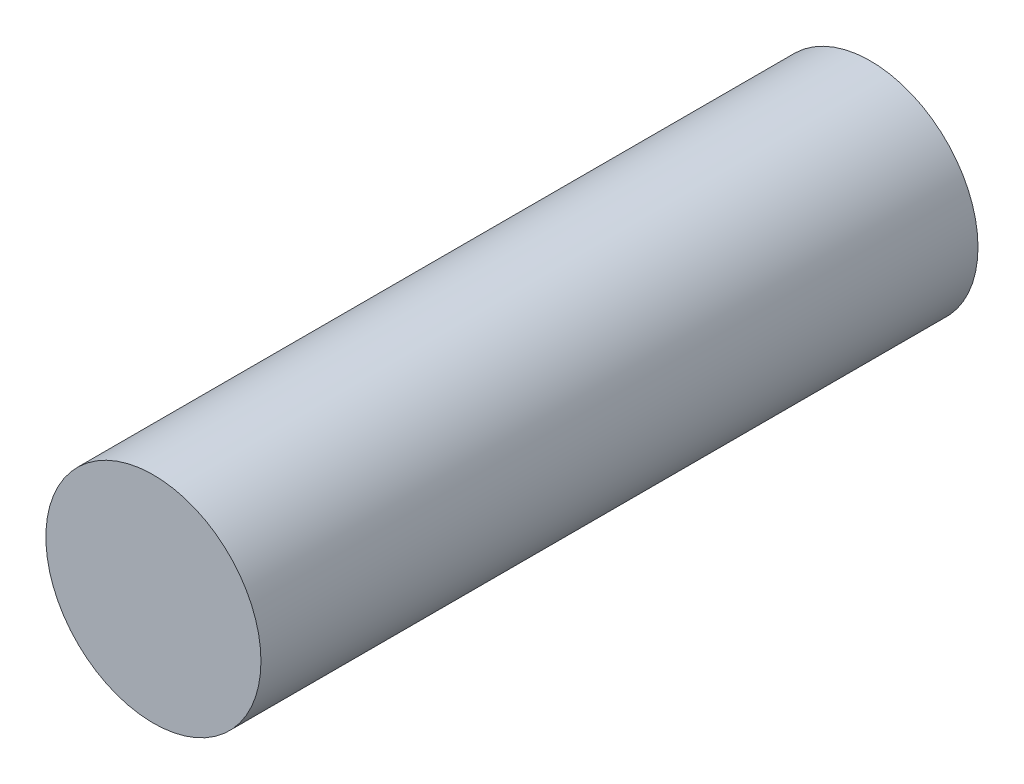
ISO-10303-21;
HEADER;
FILE_DESCRIPTION(('STEP AP214'),'2;1');
FILE_NAME('part.step','',(''),(''),'','','');
FILE_SCHEMA(('AUTOMOTIVE_DESIGN { 1 0 10303 214 1 1 1 1 }'));
ENDSEC;
DATA;
#1=APPLICATION_CONTEXT('core data for automotive mechanical design processes');
#2=APPLICATION_PROTOCOL_DEFINITION('international standard','automotive_design',2000,#1);
#3=PRODUCT_CONTEXT('',#1,'mechanical');
#4=PRODUCT('Part','Part','',(#3));
#5=PRODUCT_RELATED_PRODUCT_CATEGORY('part','',(#4));
#6=PRODUCT_DEFINITION_FORMATION('','',#4);
#7=PRODUCT_DEFINITION_CONTEXT('part definition',#1,'design');
#8=PRODUCT_DEFINITION('design','',#6,#7);
#9=PRODUCT_DEFINITION_SHAPE('','',#8);
#10=(LENGTH_UNIT() NAMED_UNIT(*) SI_UNIT(.MILLI.,.METRE.));
#11=(NAMED_UNIT(*) PLANE_ANGLE_UNIT() SI_UNIT($,.RADIAN.));
#12=(NAMED_UNIT(*) SI_UNIT($,.STERADIAN.) SOLID_ANGLE_UNIT());
#13=UNCERTAINTY_MEASURE_WITH_UNIT(LENGTH_MEASURE(1.E-05),#10,'distance_accuracy_value','');
#14=(GEOMETRIC_REPRESENTATION_CONTEXT(3) GLOBAL_UNCERTAINTY_ASSIGNED_CONTEXT((#13)) GLOBAL_UNIT_ASSIGNED_CONTEXT((#10,
#11,#12)) REPRESENTATION_CONTEXT('',''));
#15=CARTESIAN_POINT('',(0.,0.,0.));
#16=DIRECTION('',(0.,0.,1.));
#17=DIRECTION('',(1.,0.,0.));
#18=AXIS2_PLACEMENT_3D('',#15,#16,#17);
#19=CARTESIAN_POINT('',(0.,0.,100.));
#20=DIRECTION('',(0.,0.,-1.));
#21=DIRECTION('',(-1.,0.,0.));
#22=AXIS2_PLACEMENT_3D('',#19,#20,#21);
#23=CYLINDRICAL_SURFACE('',#22,15.);
#24=CARTESIAN_POINT('',(0.,0.,100.));
#25=DIRECTION('',(0.,0.,1.));
#26=DIRECTION('',(1.,0.,0.));
#27=AXIS2_PLACEMENT_3D('',#24,#25,#26);
#28=CIRCLE('',#27,15.);
#29=CARTESIAN_POINT('',(15.,0.,100.));
#30=VERTEX_POINT('',#29);
#31=EDGE_CURVE('E10',#30,#30,#28,.T.);
#32=ORIENTED_EDGE('',*,*,#31,.F.);
#33=EDGE_LOOP('',(#32));
#34=FACE_BOUND('',#33,.T.);
#35=CARTESIAN_POINT('',(0.,0.,0.));
#36=DIRECTION('',(0.,0.,1.));
#37=DIRECTION('',(1.,0.,0.));
#38=AXIS2_PLACEMENT_3D('',#35,#36,#37);
#39=CIRCLE('',#38,15.);
#40=CARTESIAN_POINT('',(15.,0.,0.));
#41=VERTEX_POINT('',#40);
#42=EDGE_CURVE('E18',#41,#41,#39,.T.);
#43=ORIENTED_EDGE('',*,*,#42,.T.);
#44=EDGE_LOOP('',(#43));
#45=FACE_BOUND('',#44,.T.);
#46=ADVANCED_FACE('F15',(#34,#45),#23,.T.);
#47=CARTESIAN_POINT('',(0.,0.,100.));
#48=DIRECTION('',(0.,0.,1.));
#49=DIRECTION('',(1.,0.,0.));
#50=AXIS2_PLACEMENT_3D('',#47,#48,#49);
#51=PLANE('',#50);
#52=ORIENTED_EDGE('',*,*,#31,.T.);
#53=EDGE_LOOP('',(#52));
#54=FACE_BOUND('',#53,.T.);
#55=ADVANCED_FACE('F30',(#54),#51,.T.);
#56=CARTESIAN_POINT('',(0.,0.,0.));
#57=DIRECTION('',(0.,0.,1.));
#58=DIRECTION('',(1.,0.,0.));
#59=AXIS2_PLACEMENT_3D('',#56,#57,#58);
#60=PLANE('',#59);
#61=ORIENTED_EDGE('',*,*,#42,.F.);
#62=EDGE_LOOP('',(#61));
#63=FACE_BOUND('',#62,.T.);
#64=ADVANCED_FACE('F28',(#63),#60,.F.);
#65=CLOSED_SHELL('',(#46,#55,#64));
#66=MANIFOLD_SOLID_BREP('B1',#65);
#67=ADVANCED_BREP_SHAPE_REPRESENTATION('',(#18,#66),#14);
#68=SHAPE_DEFINITION_REPRESENTATION(#9,#67);
ENDSEC;
END-ISO-10303-21;
